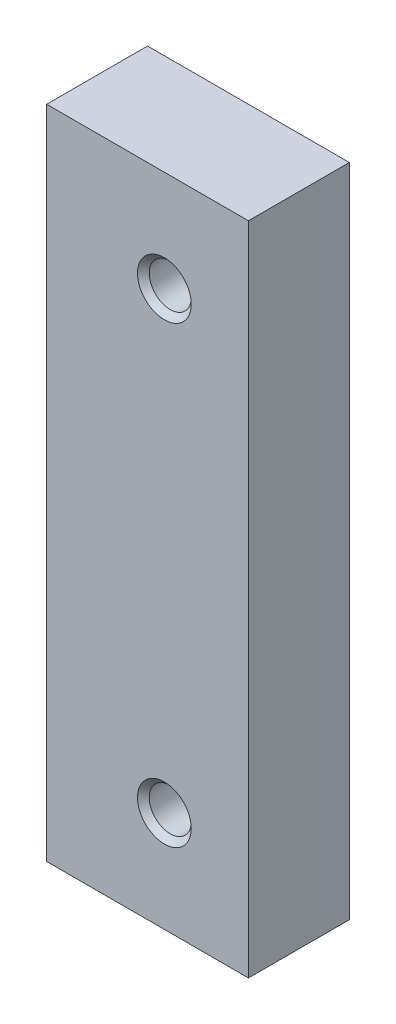
ISO-10303-21;
HEADER;
FILE_DESCRIPTION(('STEP AP214'),'2;1');
FILE_NAME('part.step','',(''),(''),'','','');
FILE_SCHEMA(('AUTOMOTIVE_DESIGN { 1 0 10303 214 1 1 1 1 }'));
ENDSEC;
DATA;
#1=APPLICATION_CONTEXT('core data for automotive mechanical design processes');
#2=APPLICATION_PROTOCOL_DEFINITION('international standard','automotive_design',2000,#1);
#3=PRODUCT_CONTEXT('',#1,'mechanical');
#4=PRODUCT('Part','Part','',(#3));
#5=PRODUCT_RELATED_PRODUCT_CATEGORY('part','',(#4));
#6=PRODUCT_DEFINITION_FORMATION('','',#4);
#7=PRODUCT_DEFINITION_CONTEXT('part definition',#1,'design');
#8=PRODUCT_DEFINITION('design','',#6,#7);
#9=PRODUCT_DEFINITION_SHAPE('','',#8);
#10=(LENGTH_UNIT() NAMED_UNIT(*) SI_UNIT(.MILLI.,.METRE.));
#11=(NAMED_UNIT(*) PLANE_ANGLE_UNIT() SI_UNIT($,.RADIAN.));
#12=(NAMED_UNIT(*) SI_UNIT($,.STERADIAN.) SOLID_ANGLE_UNIT());
#13=UNCERTAINTY_MEASURE_WITH_UNIT(LENGTH_MEASURE(1.E-05),#10,'distance_accuracy_value','');
#14=(GEOMETRIC_REPRESENTATION_CONTEXT(3) GLOBAL_UNCERTAINTY_ASSIGNED_CONTEXT((#13)) GLOBAL_UNIT_ASSIGNED_CONTEXT((#10,
#11,#12)) REPRESENTATION_CONTEXT('',''));
#15=CARTESIAN_POINT('',(0.,0.,0.));
#16=DIRECTION('',(0.,0.,1.));
#17=DIRECTION('',(1.,0.,0.));
#18=AXIS2_PLACEMENT_3D('',#15,#16,#17);
#19=CARTESIAN_POINT('',(0.,39.,0.));
#20=DIRECTION('',(1.,0.,0.));
#21=DIRECTION('',(0.,0.,-1.));
#22=AXIS2_PLACEMENT_3D('',#19,#20,#21);
#23=PLANE('',#22);
#24=DIRECTION('',(0.,0.,1.));
#25=VECTOR('',#24,1.);
#26=CARTESIAN_POINT('',(0.,0.,0.));
#27=LINE('',#26,#25);
#28=CARTESIAN_POINT('',(0.,0.,-6.));
#29=VERTEX_POINT('',#28);
#30=CARTESIAN_POINT('',(0.,0.,0.));
#31=VERTEX_POINT('',#30);
#32=EDGE_CURVE('E94',#29,#31,#27,.T.);
#33=ORIENTED_EDGE('',*,*,#32,.T.);
#34=DIRECTION('',(0.,-1.,0.));
#35=VECTOR('',#34,1.);
#36=CARTESIAN_POINT('',(0.,39.,0.));
#37=LINE('',#36,#35);
#38=CARTESIAN_POINT('',(0.,39.,0.));
#39=VERTEX_POINT('',#38);
#40=EDGE_CURVE('E11',#39,#31,#37,.T.);
#41=ORIENTED_EDGE('',*,*,#40,.F.);
#42=DIRECTION('',(0.,0.,1.));
#43=VECTOR('',#42,1.);
#44=CARTESIAN_POINT('',(0.,39.,0.));
#45=LINE('',#44,#43);
#46=CARTESIAN_POINT('',(0.,39.,-6.));
#47=VERTEX_POINT('',#46);
#48=EDGE_CURVE('E82',#47,#39,#45,.T.);
#49=ORIENTED_EDGE('',*,*,#48,.F.);
#50=DIRECTION('',(0.,-1.,0.));
#51=VECTOR('',#50,1.);
#52=CARTESIAN_POINT('',(0.,39.,-6.));
#53=LINE('',#52,#51);
#54=EDGE_CURVE('E90',#47,#29,#53,.T.);
#55=ORIENTED_EDGE('',*,*,#54,.T.);
#56=EDGE_LOOP('',(#33,#41,#49,#55));
#57=FACE_BOUND('',#56,.T.);
#58=ADVANCED_FACE('F31',(#57),#23,.F.);
#59=CARTESIAN_POINT('',(0.,39.,0.));
#60=DIRECTION('',(0.,0.,-1.));
#61=DIRECTION('',(-1.,0.,0.));
#62=AXIS2_PLACEMENT_3D('',#59,#60,#61);
#63=PLANE('',#62);
#64=CARTESIAN_POINT('',(7.,6.,0.));
#65=DIRECTION('',(0.,0.,1.));
#66=DIRECTION('',(1.,0.,0.));
#67=AXIS2_PLACEMENT_3D('',#64,#65,#66);
#68=CIRCLE('',#67,1.6);
#69=CARTESIAN_POINT('',(8.6,6.,0.));
#70=VERTEX_POINT('',#69);
#71=EDGE_CURVE('E125',#70,#70,#68,.T.);
#72=ORIENTED_EDGE('',*,*,#71,.F.);
#73=EDGE_LOOP('',(#72));
#74=FACE_BOUND('',#73,.T.);
#75=CARTESIAN_POINT('',(7.,33.,0.));
#76=DIRECTION('',(0.,0.,1.));
#77=DIRECTION('',(1.,0.,0.));
#78=AXIS2_PLACEMENT_3D('',#75,#76,#77);
#79=CIRCLE('',#78,1.6);
#80=CARTESIAN_POINT('',(8.6,33.,0.));
#81=VERTEX_POINT('',#80);
#82=EDGE_CURVE('E113',#81,#81,#79,.T.);
#83=ORIENTED_EDGE('',*,*,#82,.F.);
#84=EDGE_LOOP('',(#83));
#85=FACE_BOUND('',#84,.T.);
#86=DIRECTION('',(1.,0.,0.));
#87=VECTOR('',#86,1.);
#88=CARTESIAN_POINT('',(0.,0.,0.));
#89=LINE('',#88,#87);
#90=CARTESIAN_POINT('',(12.,0.,0.));
#91=VERTEX_POINT('',#90);
#92=EDGE_CURVE('E86',#31,#91,#89,.T.);
#93=ORIENTED_EDGE('',*,*,#92,.T.);
#94=DIRECTION('',(0.,-1.,0.));
#95=VECTOR('',#94,1.);
#96=CARTESIAN_POINT('',(12.,39.,0.));
#97=LINE('',#96,#95);
#98=CARTESIAN_POINT('',(12.,39.,0.));
#99=VERTEX_POINT('',#98);
#100=EDGE_CURVE('E39',#99,#91,#97,.T.);
#101=ORIENTED_EDGE('',*,*,#100,.F.);
#102=DIRECTION('',(1.,0.,0.));
#103=VECTOR('',#102,1.);
#104=CARTESIAN_POINT('',(0.,39.,0.));
#105=LINE('',#104,#103);
#106=EDGE_CURVE('E77',#39,#99,#105,.T.);
#107=ORIENTED_EDGE('',*,*,#106,.F.);
#108=ORIENTED_EDGE('',*,*,#40,.T.);
#109=EDGE_LOOP('',(#93,#101,#107,#108));
#110=FACE_BOUND('',#109,.T.);
#111=ADVANCED_FACE('F85',(#74,#85,#110),#63,.F.);
#112=CARTESIAN_POINT('',(12.,39.,0.));
#113=DIRECTION('',(-1.,0.,0.));
#114=DIRECTION('',(0.,0.,1.));
#115=AXIS2_PLACEMENT_3D('',#112,#113,#114);
#116=PLANE('',#115);
#117=DIRECTION('',(0.,0.,-1.));
#118=VECTOR('',#117,1.);
#119=CARTESIAN_POINT('',(12.,0.,0.));
#120=LINE('',#119,#118);
#121=CARTESIAN_POINT('',(12.,0.,-6.));
#122=VERTEX_POINT('',#121);
#123=EDGE_CURVE('E64',#91,#122,#120,.T.);
#124=ORIENTED_EDGE('',*,*,#123,.T.);
#125=DIRECTION('',(0.,-1.,0.));
#126=VECTOR('',#125,1.);
#127=CARTESIAN_POINT('',(12.,39.,-6.));
#128=LINE('',#127,#126);
#129=CARTESIAN_POINT('',(12.,39.,-6.));
#130=VERTEX_POINT('',#129);
#131=EDGE_CURVE('E87',#130,#122,#128,.T.);
#132=ORIENTED_EDGE('',*,*,#131,.F.);
#133=DIRECTION('',(0.,0.,-1.));
#134=VECTOR('',#133,1.);
#135=CARTESIAN_POINT('',(12.,39.,0.));
#136=LINE('',#135,#134);
#137=EDGE_CURVE('E80',#99,#130,#136,.T.);
#138=ORIENTED_EDGE('',*,*,#137,.F.);
#139=ORIENTED_EDGE('',*,*,#100,.T.);
#140=EDGE_LOOP('',(#124,#132,#138,#139));
#141=FACE_BOUND('',#140,.T.);
#142=ADVANCED_FACE('F88',(#141),#116,.F.);
#143=CARTESIAN_POINT('',(0.,39.,-6.));
#144=DIRECTION('',(0.,0.,1.));
#145=DIRECTION('',(1.,0.,0.));
#146=AXIS2_PLACEMENT_3D('',#143,#144,#145);
#147=PLANE('',#146);
#148=CARTESIAN_POINT('',(7.,6.,-6.));
#149=DIRECTION('',(0.,0.,1.));
#150=DIRECTION('',(1.,0.,0.));
#151=AXIS2_PLACEMENT_3D('',#148,#149,#150);
#152=CIRCLE('',#151,1.6);
#153=CARTESIAN_POINT('',(8.6,6.,-6.));
#154=VERTEX_POINT('',#153);
#155=EDGE_CURVE('E128',#154,#154,#152,.T.);
#156=ORIENTED_EDGE('',*,*,#155,.T.);
#157=EDGE_LOOP('',(#156));
#158=FACE_BOUND('',#157,.T.);
#159=CARTESIAN_POINT('',(7.,33.,-6.));
#160=DIRECTION('',(0.,0.,1.));
#161=DIRECTION('',(1.,0.,0.));
#162=AXIS2_PLACEMENT_3D('',#159,#160,#161);
#163=CIRCLE('',#162,1.6);
#164=CARTESIAN_POINT('',(8.6,33.,-6.));
#165=VERTEX_POINT('',#164);
#166=EDGE_CURVE('E116',#165,#165,#163,.T.);
#167=ORIENTED_EDGE('',*,*,#166,.T.);
#168=EDGE_LOOP('',(#167));
#169=FACE_BOUND('',#168,.T.);
#170=DIRECTION('',(-1.,0.,0.));
#171=VECTOR('',#170,1.);
#172=CARTESIAN_POINT('',(0.,0.,-6.));
#173=LINE('',#172,#171);
#174=EDGE_CURVE('E70',#122,#29,#173,.T.);
#175=ORIENTED_EDGE('',*,*,#174,.T.);
#176=ORIENTED_EDGE('',*,*,#54,.F.);
#177=DIRECTION('',(-1.,0.,0.));
#178=VECTOR('',#177,1.);
#179=CARTESIAN_POINT('',(0.,39.,-6.));
#180=LINE('',#179,#178);
#181=EDGE_CURVE('E47',#130,#47,#180,.T.);
#182=ORIENTED_EDGE('',*,*,#181,.F.);
#183=ORIENTED_EDGE('',*,*,#131,.T.);
#184=EDGE_LOOP('',(#175,#176,#182,#183));
#185=FACE_BOUND('',#184,.T.);
#186=ADVANCED_FACE('F102',(#158,#169,#185),#147,.F.);
#187=CARTESIAN_POINT('',(0.,39.,-6.));
#188=DIRECTION('',(0.,-1.,0.));
#189=DIRECTION('',(0.,0.,-1.));
#190=AXIS2_PLACEMENT_3D('',#187,#188,#189);
#191=PLANE('',#190);
#192=ORIENTED_EDGE('',*,*,#48,.T.);
#193=ORIENTED_EDGE('',*,*,#106,.T.);
#194=ORIENTED_EDGE('',*,*,#137,.T.);
#195=ORIENTED_EDGE('',*,*,#181,.T.);
#196=EDGE_LOOP('',(#192,#193,#194,#195));
#197=FACE_BOUND('',#196,.T.);
#198=ADVANCED_FACE('F78',(#197),#191,.F.);
#199=CARTESIAN_POINT('',(0.,0.,-6.));
#200=DIRECTION('',(0.,-1.,0.));
#201=DIRECTION('',(0.,0.,-1.));
#202=AXIS2_PLACEMENT_3D('',#199,#200,#201);
#203=PLANE('',#202);
#204=ORIENTED_EDGE('',*,*,#32,.F.);
#205=ORIENTED_EDGE('',*,*,#174,.F.);
#206=ORIENTED_EDGE('',*,*,#123,.F.);
#207=ORIENTED_EDGE('',*,*,#92,.F.);
#208=EDGE_LOOP('',(#204,#205,#206,#207));
#209=FACE_BOUND('',#208,.T.);
#210=ADVANCED_FACE('F105',(#209),#203,.T.);
#211=CARTESIAN_POINT('',(7.,33.,-5.65));
#212=DIRECTION('',(0.,0.,-1.));
#213=DIRECTION('',(-1.,0.,0.));
#214=AXIS2_PLACEMENT_3D('',#211,#212,#213);
#215=CONICAL_SURFACE('',#214,1.25,0.785398163397447);
#216=ORIENTED_EDGE('',*,*,#166,.F.);
#217=EDGE_LOOP('',(#216));
#218=FACE_BOUND('',#217,.T.);
#219=CARTESIAN_POINT('',(7.,33.,-5.65));
#220=DIRECTION('',(0.,0.,1.));
#221=DIRECTION('',(1.,0.,0.));
#222=AXIS2_PLACEMENT_3D('',#219,#220,#221);
#223=CIRCLE('',#222,1.25);
#224=CARTESIAN_POINT('',(8.25,33.,-5.65));
#225=VERTEX_POINT('',#224);
#226=EDGE_CURVE('E97',#225,#225,#223,.T.);
#227=ORIENTED_EDGE('',*,*,#226,.T.);
#228=EDGE_LOOP('',(#227));
#229=FACE_BOUND('',#228,.T.);
#230=ADVANCED_FACE('F164',(#218,#229),#215,.F.);
#231=CARTESIAN_POINT('',(7.,33.,0.));
#232=DIRECTION('',(0.,0.,1.));
#233=DIRECTION('',(1.,0.,0.));
#234=AXIS2_PLACEMENT_3D('',#231,#232,#233);
#235=CYLINDRICAL_SURFACE('',#234,1.25);
#236=ORIENTED_EDGE('',*,*,#226,.F.);
#237=EDGE_LOOP('',(#236));
#238=FACE_BOUND('',#237,.T.);
#239=CARTESIAN_POINT('',(7.,33.,-0.35));
#240=DIRECTION('',(0.,0.,1.));
#241=DIRECTION('',(1.,0.,0.));
#242=AXIS2_PLACEMENT_3D('',#239,#240,#241);
#243=CIRCLE('',#242,1.25);
#244=CARTESIAN_POINT('',(8.25,33.,-0.35));
#245=VERTEX_POINT('',#244);
#246=EDGE_CURVE('E110',#245,#245,#243,.T.);
#247=ORIENTED_EDGE('',*,*,#246,.T.);
#248=EDGE_LOOP('',(#247));
#249=FACE_BOUND('',#248,.T.);
#250=ADVANCED_FACE('F158',(#238,#249),#235,.F.);
#251=CARTESIAN_POINT('',(7.,33.,0.));
#252=DIRECTION('',(0.,0.,1.));
#253=DIRECTION('',(1.,0.,0.));
#254=AXIS2_PLACEMENT_3D('',#251,#252,#253);
#255=CONICAL_SURFACE('',#254,1.6,0.785398163397446);
#256=ORIENTED_EDGE('',*,*,#246,.F.);
#257=EDGE_LOOP('',(#256));
#258=FACE_BOUND('',#257,.T.);
#259=ORIENTED_EDGE('',*,*,#82,.T.);
#260=EDGE_LOOP('',(#259));
#261=FACE_BOUND('',#260,.T.);
#262=ADVANCED_FACE('F138',(#258,#261),#255,.F.);
#263=CARTESIAN_POINT('',(7.,6.,-5.65));
#264=DIRECTION('',(0.,0.,-1.));
#265=DIRECTION('',(-1.,0.,0.));
#266=AXIS2_PLACEMENT_3D('',#263,#264,#265);
#267=CONICAL_SURFACE('',#266,1.25,0.785398163397447);
#268=ORIENTED_EDGE('',*,*,#155,.F.);
#269=EDGE_LOOP('',(#268));
#270=FACE_BOUND('',#269,.T.);
#271=CARTESIAN_POINT('',(7.,6.,-5.65));
#272=DIRECTION('',(0.,0.,1.));
#273=DIRECTION('',(1.,0.,0.));
#274=AXIS2_PLACEMENT_3D('',#271,#272,#273);
#275=CIRCLE('',#274,1.25);
#276=CARTESIAN_POINT('',(8.25,6.,-5.65));
#277=VERTEX_POINT('',#276);
#278=EDGE_CURVE('E119',#277,#277,#275,.T.);
#279=ORIENTED_EDGE('',*,*,#278,.T.);
#280=EDGE_LOOP('',(#279));
#281=FACE_BOUND('',#280,.T.);
#282=ADVANCED_FACE('F134',(#270,#281),#267,.F.);
#283=CARTESIAN_POINT('',(7.,6.,0.));
#284=DIRECTION('',(0.,0.,1.));
#285=DIRECTION('',(1.,0.,0.));
#286=AXIS2_PLACEMENT_3D('',#283,#284,#285);
#287=CYLINDRICAL_SURFACE('',#286,1.25);
#288=ORIENTED_EDGE('',*,*,#278,.F.);
#289=EDGE_LOOP('',(#288));
#290=FACE_BOUND('',#289,.T.);
#291=CARTESIAN_POINT('',(7.,6.,-0.35));
#292=DIRECTION('',(0.,0.,1.));
#293=DIRECTION('',(1.,0.,0.));
#294=AXIS2_PLACEMENT_3D('',#291,#292,#293);
#295=CIRCLE('',#294,1.25);
#296=CARTESIAN_POINT('',(8.25,6.,-0.35));
#297=VERTEX_POINT('',#296);
#298=EDGE_CURVE('E122',#297,#297,#295,.T.);
#299=ORIENTED_EDGE('',*,*,#298,.T.);
#300=EDGE_LOOP('',(#299));
#301=FACE_BOUND('',#300,.T.);
#302=ADVANCED_FACE('F137',(#290,#301),#287,.F.);
#303=CARTESIAN_POINT('',(7.,6.,0.));
#304=DIRECTION('',(0.,0.,1.));
#305=DIRECTION('',(1.,0.,0.));
#306=AXIS2_PLACEMENT_3D('',#303,#304,#305);
#307=CONICAL_SURFACE('',#306,1.6,0.785398163397446);
#308=ORIENTED_EDGE('',*,*,#298,.F.);
#309=EDGE_LOOP('',(#308));
#310=FACE_BOUND('',#309,.T.);
#311=ORIENTED_EDGE('',*,*,#71,.T.);
#312=EDGE_LOOP('',(#311));
#313=FACE_BOUND('',#312,.T.);
#314=ADVANCED_FACE('F144',(#310,#313),#307,.F.);
#315=CLOSED_SHELL('',(#58,#111,#142,#186,#198,#210,#230,#250,#262,#282,#302,#314));
#316=MANIFOLD_SOLID_BREP('B2',#315);
#317=ADVANCED_BREP_SHAPE_REPRESENTATION('',(#18,#316),#14);
#318=SHAPE_DEFINITION_REPRESENTATION(#9,#317);
ENDSEC;
END-ISO-10303-21;
